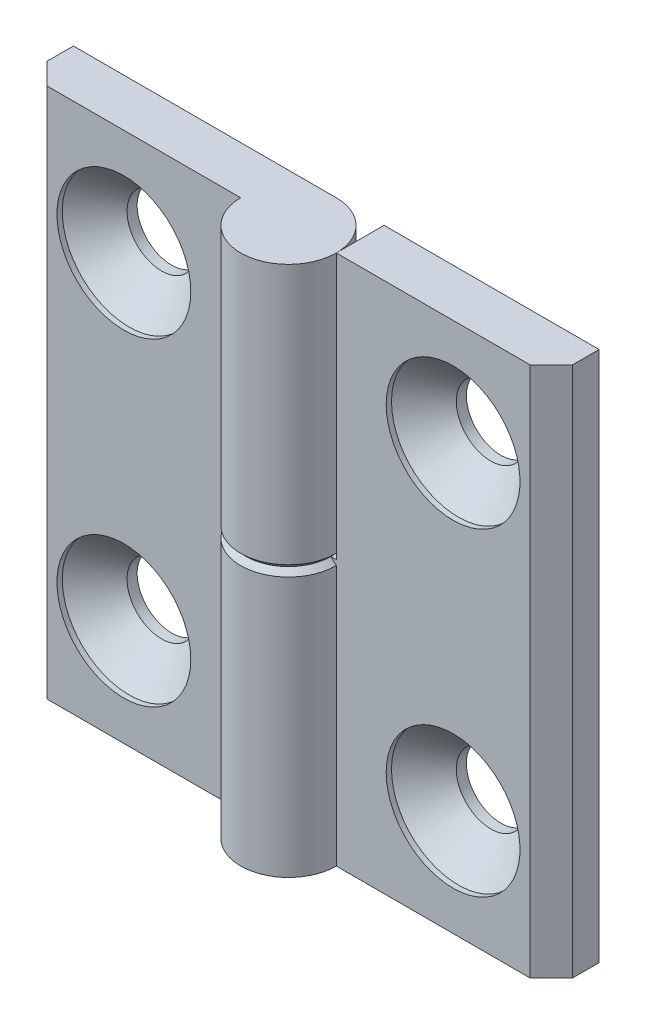
ISO-10303-21;
HEADER;
FILE_DESCRIPTION(('STEP AP214'),'2;1');
FILE_NAME('part.step','',(''),(''),'','','');
FILE_SCHEMA(('AUTOMOTIVE_DESIGN { 1 0 10303 214 1 1 1 1 }'));
ENDSEC;
DATA;
#1=APPLICATION_CONTEXT('core data for automotive mechanical design processes');
#2=APPLICATION_PROTOCOL_DEFINITION('international standard','automotive_design',2000,#1);
#3=PRODUCT_CONTEXT('',#1,'mechanical');
#4=PRODUCT('Part','Part','',(#3));
#5=PRODUCT_RELATED_PRODUCT_CATEGORY('part','',(#4));
#6=PRODUCT_DEFINITION_FORMATION('','',#4);
#7=PRODUCT_DEFINITION_CONTEXT('part definition',#1,'design');
#8=PRODUCT_DEFINITION('design','',#6,#7);
#9=PRODUCT_DEFINITION_SHAPE('','',#8);
#10=(LENGTH_UNIT() NAMED_UNIT(*) SI_UNIT(.MILLI.,.METRE.));
#11=(NAMED_UNIT(*) PLANE_ANGLE_UNIT() SI_UNIT($,.RADIAN.));
#12=(NAMED_UNIT(*) SI_UNIT($,.STERADIAN.) SOLID_ANGLE_UNIT());
#13=UNCERTAINTY_MEASURE_WITH_UNIT(LENGTH_MEASURE(1.E-05),#10,'distance_accuracy_value','');
#14=(GEOMETRIC_REPRESENTATION_CONTEXT(3) GLOBAL_UNCERTAINTY_ASSIGNED_CONTEXT((#13)) GLOBAL_UNIT_ASSIGNED_CONTEXT((#10,
#11,#12)) REPRESENTATION_CONTEXT('',''));
#15=CARTESIAN_POINT('',(0.,0.,0.));
#16=DIRECTION('',(0.,0.,1.));
#17=DIRECTION('',(1.,0.,0.));
#18=AXIS2_PLACEMENT_3D('',#15,#16,#17);
#19=CARTESIAN_POINT('',(0.,-25.,0.));
#20=DIRECTION('',(0.,1.,0.));
#21=DIRECTION('',(0.,0.,-1.));
#22=AXIS2_PLACEMENT_3D('',#19,#20,#21);
#23=CYLINDRICAL_SURFACE('',#22,4.5);
#24=DIRECTION('',(0.,1.,0.));
#25=VECTOR('',#24,1.);
#26=CARTESIAN_POINT('',(4.5,-25.,0.));
#27=LINE('',#26,#25);
#28=CARTESIAN_POINT('',(4.5,-25.,0.));
#29=VERTEX_POINT('',#28);
#30=CARTESIAN_POINT('',(4.5,-0.499999999999987,0.));
#31=VERTEX_POINT('',#30);
#32=EDGE_CURVE('E157',#29,#31,#27,.T.);
#33=ORIENTED_EDGE('',*,*,#32,.T.);
#34=CARTESIAN_POINT('',(0.,-0.499999999999987,0.));
#35=DIRECTION('',(0.,-1.,0.));
#36=DIRECTION('',(0.,0.,1.));
#37=AXIS2_PLACEMENT_3D('',#34,#35,#36);
#38=CIRCLE('',#37,4.5);
#39=CARTESIAN_POINT('',(0.,-0.499999999999987,-4.5));
#40=VERTEX_POINT('',#39);
#41=EDGE_CURVE('E175',#31,#40,#38,.T.);
#42=ORIENTED_EDGE('',*,*,#41,.T.);
#43=DIRECTION('',(0.,1.,0.));
#44=VECTOR('',#43,1.);
#45=CARTESIAN_POINT('',(0.,-25.,-4.5));
#46=LINE('',#45,#44);
#47=CARTESIAN_POINT('',(0.,-25.,-4.5));
#48=VERTEX_POINT('',#47);
#49=EDGE_CURVE('E167',#48,#40,#46,.T.);
#50=ORIENTED_EDGE('',*,*,#49,.F.);
#51=CARTESIAN_POINT('',(0.,-25.,0.));
#52=DIRECTION('',(0.,-1.,0.));
#53=DIRECTION('',(0.,0.,1.));
#54=AXIS2_PLACEMENT_3D('',#51,#52,#53);
#55=CIRCLE('',#54,4.5);
#56=EDGE_CURVE('E156',#29,#48,#55,.T.);
#57=ORIENTED_EDGE('',*,*,#56,.F.);
#58=EDGE_LOOP('',(#33,#42,#50,#57));
#59=FACE_BOUND('',#58,.T.);
#60=ADVANCED_FACE('F46',(#59),#23,.T.);
#61=CARTESIAN_POINT('',(0.,-25.,-4.5));
#62=DIRECTION('',(0.,0.,1.));
#63=DIRECTION('',(-1.,0.,0.));
#64=AXIS2_PLACEMENT_3D('',#61,#62,#63);
#65=PLANE('',#64);
#66=CARTESIAN_POINT('',(15.5,-15.,-4.50000000000012));
#67=DIRECTION('',(0.,0.,1.));
#68=DIRECTION('',(-1.,0.,0.));
#69=AXIS2_PLACEMENT_3D('',#66,#67,#68);
#70=CIRCLE('',#69,3.25);
#71=CARTESIAN_POINT('',(12.25,-15.,-4.50000000000009));
#72=VERTEX_POINT('',#71);
#73=EDGE_CURVE('E197',#72,#72,#70,.T.);
#74=ORIENTED_EDGE('',*,*,#73,.T.);
#75=EDGE_LOOP('',(#74));
#76=FACE_BOUND('',#75,.T.);
#77=CARTESIAN_POINT('',(15.5,15.,-4.50000000000012));
#78=DIRECTION('',(0.,0.,1.));
#79=DIRECTION('',(-1.,0.,0.));
#80=AXIS2_PLACEMENT_3D('',#77,#78,#79);
#81=CIRCLE('',#80,3.25);
#82=CARTESIAN_POINT('',(12.25,15.,-4.50000000000009));
#83=VERTEX_POINT('',#82);
#84=EDGE_CURVE('E139',#83,#83,#81,.T.);
#85=ORIENTED_EDGE('',*,*,#84,.T.);
#86=EDGE_LOOP('',(#85));
#87=FACE_BOUND('',#86,.T.);
#88=ORIENTED_EDGE('',*,*,#49,.T.);
#89=DIRECTION('',(1.,0.,0.));
#90=VECTOR('',#89,1.);
#91=CARTESIAN_POINT('',(0.,-0.499999999999987,-4.5));
#92=LINE('',#91,#90);
#93=CARTESIAN_POINT('',(4.49999999999997,-0.499999999999987,-4.50000000000003));
#94=VERTEX_POINT('',#93);
#95=EDGE_CURVE('E138',#40,#94,#92,.T.);
#96=ORIENTED_EDGE('',*,*,#95,.T.);
#97=DIRECTION('',(0.,1.,0.));
#98=VECTOR('',#97,1.);
#99=CARTESIAN_POINT('',(4.49999999999997,25.,-4.50000000000003));
#100=LINE('',#99,#98);
#101=CARTESIAN_POINT('',(4.49999999999997,25.,-4.50000000000003));
#102=VERTEX_POINT('',#101);
#103=EDGE_CURVE('E119',#94,#102,#100,.T.);
#104=ORIENTED_EDGE('',*,*,#103,.T.);
#105=DIRECTION('',(1.,0.,0.));
#106=VECTOR('',#105,1.);
#107=CARTESIAN_POINT('',(0.,25.,-4.5));
#108=LINE('',#107,#106);
#109=CARTESIAN_POINT('',(24.75,25.,-4.50000000000018));
#110=VERTEX_POINT('',#109);
#111=EDGE_CURVE('E135',#102,#110,#108,.T.);
#112=ORIENTED_EDGE('',*,*,#111,.T.);
#113=DIRECTION('',(0.,1.,0.));
#114=VECTOR('',#113,1.);
#115=CARTESIAN_POINT('',(24.75,-25.,-4.50000000000018));
#116=LINE('',#115,#114);
#117=CARTESIAN_POINT('',(24.75,-25.,-4.50000000000018));
#118=VERTEX_POINT('',#117);
#119=EDGE_CURVE('E165',#118,#110,#116,.T.);
#120=ORIENTED_EDGE('',*,*,#119,.F.);
#121=DIRECTION('',(1.,0.,0.));
#122=VECTOR('',#121,1.);
#123=CARTESIAN_POINT('',(0.,-25.,-4.5));
#124=LINE('',#123,#122);
#125=EDGE_CURVE('E213',#48,#118,#124,.T.);
#126=ORIENTED_EDGE('',*,*,#125,.F.);
#127=EDGE_LOOP('',(#88,#96,#104,#112,#120,#126));
#128=FACE_BOUND('',#127,.T.);
#129=ADVANCED_FACE('F133',(#76,#87,#128),#65,.F.);
#130=CARTESIAN_POINT('',(24.75,-25.,-4.50000000000018));
#131=DIRECTION('',(-1.,0.,0.));
#132=DIRECTION('',(0.,0.,-1.));
#133=AXIS2_PLACEMENT_3D('',#130,#131,#132);
#134=PLANE('',#133);
#135=DIRECTION('',(0.,0.,1.));
#136=VECTOR('',#135,1.);
#137=CARTESIAN_POINT('',(24.75,25.,-4.50000000000018));
#138=LINE('',#137,#136);
#139=CARTESIAN_POINT('',(24.75,25.,-2.00000000000018));
#140=VERTEX_POINT('',#139);
#141=EDGE_CURVE('E144',#110,#140,#138,.T.);
#142=ORIENTED_EDGE('',*,*,#141,.T.);
#143=DIRECTION('',(0.,1.,0.));
#144=VECTOR('',#143,1.);
#145=CARTESIAN_POINT('',(24.75,-25.,-2.00000000000018));
#146=LINE('',#145,#144);
#147=CARTESIAN_POINT('',(24.75,-25.,-2.00000000000018));
#148=VERTEX_POINT('',#147);
#149=EDGE_CURVE('E162',#148,#140,#146,.T.);
#150=ORIENTED_EDGE('',*,*,#149,.F.);
#151=DIRECTION('',(0.,0.,1.));
#152=VECTOR('',#151,1.);
#153=CARTESIAN_POINT('',(24.75,-25.,-4.50000000000018));
#154=LINE('',#153,#152);
#155=EDGE_CURVE('E215',#118,#148,#154,.T.);
#156=ORIENTED_EDGE('',*,*,#155,.F.);
#157=ORIENTED_EDGE('',*,*,#119,.T.);
#158=EDGE_LOOP('',(#142,#150,#156,#157));
#159=FACE_BOUND('',#158,.T.);
#160=ADVANCED_FACE('F229',(#159),#134,.F.);
#161=CARTESIAN_POINT('',(24.75,-25.,-2.00000000000018));
#162=DIRECTION('',(-0.707106781186548,0.,-0.707106781186547));
#163=DIRECTION('',(0.707106781186547,0.,-0.707106781186548));
#164=AXIS2_PLACEMENT_3D('',#161,#162,#163);
#165=PLANE('',#164);
#166=DIRECTION('',(-0.707106781186547,0.,0.707106781186548));
#167=VECTOR('',#166,1.);
#168=CARTESIAN_POINT('',(24.75,25.,-2.00000000000018));
#169=LINE('',#168,#167);
#170=CARTESIAN_POINT('',(22.75,25.,-1.70068490391401E-13));
#171=VERTEX_POINT('',#170);
#172=EDGE_CURVE('E146',#140,#171,#169,.T.);
#173=ORIENTED_EDGE('',*,*,#172,.T.);
#174=DIRECTION('',(0.,1.,0.));
#175=VECTOR('',#174,1.);
#176=CARTESIAN_POINT('',(22.75,-25.,-1.70068490391401E-13));
#177=LINE('',#176,#175);
#178=CARTESIAN_POINT('',(22.75,-25.,-1.70068490391401E-13));
#179=VERTEX_POINT('',#178);
#180=EDGE_CURVE('E159',#179,#171,#177,.T.);
#181=ORIENTED_EDGE('',*,*,#180,.F.);
#182=DIRECTION('',(-0.707106781186547,0.,0.707106781186548));
#183=VECTOR('',#182,1.);
#184=CARTESIAN_POINT('',(24.75,-25.,-2.00000000000018));
#185=LINE('',#184,#183);
#186=EDGE_CURVE('E216',#148,#179,#185,.T.);
#187=ORIENTED_EDGE('',*,*,#186,.F.);
#188=ORIENTED_EDGE('',*,*,#149,.T.);
#189=EDGE_LOOP('',(#173,#181,#187,#188));
#190=FACE_BOUND('',#189,.T.);
#191=ADVANCED_FACE('F231',(#190),#165,.F.);
#192=CARTESIAN_POINT('',(22.75,-25.,-1.70068490391401E-13));
#193=DIRECTION('',(0.,0.,-1.));
#194=DIRECTION('',(1.,0.,0.));
#195=AXIS2_PLACEMENT_3D('',#192,#193,#194);
#196=PLANE('',#195);
#197=CARTESIAN_POINT('',(15.5,-15.,-1.16045572093348E-13));
#198=DIRECTION('',(0.,0.,1.));
#199=DIRECTION('',(-1.,0.,0.));
#200=AXIS2_PLACEMENT_3D('',#197,#198,#199);
#201=CIRCLE('',#200,6.3);
#202=CARTESIAN_POINT('',(9.2,-15.,0.));
#203=VERTEX_POINT('',#202);
#204=EDGE_CURVE('E185',#203,#203,#201,.T.);
#205=ORIENTED_EDGE('',*,*,#204,.F.);
#206=EDGE_LOOP('',(#205));
#207=FACE_BOUND('',#206,.T.);
#208=CARTESIAN_POINT('',(15.5,15.,-1.16045572093348E-13));
#209=DIRECTION('',(0.,0.,1.));
#210=DIRECTION('',(-1.,0.,0.));
#211=AXIS2_PLACEMENT_3D('',#208,#209,#210);
#212=CIRCLE('',#211,6.3);
#213=CARTESIAN_POINT('',(9.2,15.,0.));
#214=VERTEX_POINT('',#213);
#215=EDGE_CURVE('E200',#214,#214,#212,.T.);
#216=ORIENTED_EDGE('',*,*,#215,.F.);
#217=EDGE_LOOP('',(#216));
#218=FACE_BOUND('',#217,.T.);
#219=DIRECTION('',(-1.,0.,0.));
#220=VECTOR('',#219,1.);
#221=CARTESIAN_POINT('',(22.75,25.,-1.70068490391401E-13));
#222=LINE('',#221,#220);
#223=CARTESIAN_POINT('',(4.5,25.,0.));
#224=VERTEX_POINT('',#223);
#225=EDGE_CURVE('E154',#171,#224,#222,.T.);
#226=ORIENTED_EDGE('',*,*,#225,.T.);
#227=DIRECTION('',(0.,-1.,0.));
#228=VECTOR('',#227,1.);
#229=CARTESIAN_POINT('',(4.5,-25.,0.));
#230=LINE('',#229,#228);
#231=CARTESIAN_POINT('',(4.5,0.,0.));
#232=VERTEX_POINT('',#231);
#233=EDGE_CURVE('E123',#224,#232,#230,.T.);
#234=ORIENTED_EDGE('',*,*,#233,.T.);
#235=DIRECTION('',(1.,0.,0.));
#236=VECTOR('',#235,1.);
#237=CARTESIAN_POINT('',(-4.5,0.,0.));
#238=LINE('',#237,#236);
#239=CARTESIAN_POINT('',(4.00000000000001,0.,0.));
#240=VERTEX_POINT('',#239);
#241=EDGE_CURVE('E170',#240,#232,#238,.T.);
#242=ORIENTED_EDGE('',*,*,#241,.F.);
#243=DIRECTION('',(0.707106781186553,-0.707106781186542,0.));
#244=VECTOR('',#243,1.);
#245=CARTESIAN_POINT('',(0.,3.99999999999994,0.));
#246=LINE('',#245,#244);
#247=EDGE_CURVE('E12',#240,#31,#246,.T.);
#248=ORIENTED_EDGE('',*,*,#247,.T.);
#249=ORIENTED_EDGE('',*,*,#32,.F.);
#250=DIRECTION('',(-1.,0.,0.));
#251=VECTOR('',#250,1.);
#252=CARTESIAN_POINT('',(22.75,-25.,-1.70068490391401E-13));
#253=LINE('',#252,#251);
#254=EDGE_CURVE('E150',#179,#29,#253,.T.);
#255=ORIENTED_EDGE('',*,*,#254,.F.);
#256=ORIENTED_EDGE('',*,*,#180,.T.);
#257=EDGE_LOOP('',(#226,#234,#242,#248,#249,#255,#256));
#258=FACE_BOUND('',#257,.T.);
#259=ADVANCED_FACE('F224',(#207,#218,#258),#196,.F.);
#260=CARTESIAN_POINT('',(0.,-25.,0.));
#261=DIRECTION('',(0.,-1.,0.));
#262=DIRECTION('',(0.,0.,1.));
#263=AXIS2_PLACEMENT_3D('',#260,#261,#262);
#264=PLANE('',#263);
#265=ORIENTED_EDGE('',*,*,#56,.T.);
#266=ORIENTED_EDGE('',*,*,#125,.T.);
#267=ORIENTED_EDGE('',*,*,#155,.T.);
#268=ORIENTED_EDGE('',*,*,#186,.T.);
#269=ORIENTED_EDGE('',*,*,#254,.T.);
#270=EDGE_LOOP('',(#265,#266,#267,#268,#269));
#271=FACE_BOUND('',#270,.T.);
#272=ADVANCED_FACE('F221',(#271),#264,.T.);
#273=CARTESIAN_POINT('',(0.,25.,0.));
#274=DIRECTION('',(0.,-1.,0.));
#275=DIRECTION('',(0.,0.,1.));
#276=AXIS2_PLACEMENT_3D('',#273,#274,#275);
#277=PLANE('',#276);
#278=ORIENTED_EDGE('',*,*,#111,.F.);
#279=DIRECTION('',(0.,0.,1.));
#280=VECTOR('',#279,1.);
#281=CARTESIAN_POINT('',(4.49999999999997,25.,-4.50000000000003));
#282=LINE('',#281,#280);
#283=EDGE_CURVE('E116',#102,#224,#282,.T.);
#284=ORIENTED_EDGE('',*,*,#283,.T.);
#285=ORIENTED_EDGE('',*,*,#225,.F.);
#286=ORIENTED_EDGE('',*,*,#172,.F.);
#287=ORIENTED_EDGE('',*,*,#141,.F.);
#288=EDGE_LOOP('',(#278,#284,#285,#286,#287));
#289=FACE_BOUND('',#288,.T.);
#290=ADVANCED_FACE('F142',(#289),#277,.F.);
#291=CARTESIAN_POINT('',(-4.50000000000003,0.,-4.49999999999997));
#292=DIRECTION('',(0.,-1.,0.));
#293=DIRECTION('',(0.,0.,1.));
#294=AXIS2_PLACEMENT_3D('',#291,#292,#293);
#295=PLANE('',#294);
#296=DIRECTION('',(0.,0.,1.));
#297=VECTOR('',#296,1.);
#298=CARTESIAN_POINT('',(4.49999999999997,0.,-4.50000000000003));
#299=LINE('',#298,#297);
#300=CARTESIAN_POINT('',(4.49999999999997,0.,-4.00000000000004));
#301=VERTEX_POINT('',#300);
#302=EDGE_CURVE('E128',#301,#232,#299,.T.);
#303=ORIENTED_EDGE('',*,*,#302,.F.);
#304=DIRECTION('',(-1.,0.,0.));
#305=VECTOR('',#304,1.);
#306=CARTESIAN_POINT('',(-4.50000000000003,0.,-3.99999999999997));
#307=LINE('',#306,#305);
#308=CARTESIAN_POINT('',(0.,0.,-4.00000000000001));
#309=VERTEX_POINT('',#308);
#310=EDGE_CURVE('E69',#301,#309,#307,.T.);
#311=ORIENTED_EDGE('',*,*,#310,.T.);
#312=CARTESIAN_POINT('',(0.,0.,0.));
#313=DIRECTION('',(0.,-1.,0.));
#314=DIRECTION('',(0.,0.,1.));
#315=AXIS2_PLACEMENT_3D('',#312,#313,#314);
#316=CIRCLE('',#315,4.00000000000001);
#317=EDGE_CURVE('E172',#309,#240,#316,.F.);
#318=ORIENTED_EDGE('',*,*,#317,.T.);
#319=ORIENTED_EDGE('',*,*,#241,.T.);
#320=EDGE_LOOP('',(#303,#311,#318,#319));
#321=FACE_BOUND('',#320,.T.);
#322=ADVANCED_FACE('F178',(#321),#295,.F.);
#323=CARTESIAN_POINT('',(4.49999999999997,25.,-4.50000000000003));
#324=DIRECTION('',(1.,0.,0.));
#325=DIRECTION('',(0.,0.,1.));
#326=AXIS2_PLACEMENT_3D('',#323,#324,#325);
#327=PLANE('',#326);
#328=ORIENTED_EDGE('',*,*,#283,.F.);
#329=ORIENTED_EDGE('',*,*,#103,.F.);
#330=DIRECTION('',(0.,-0.707106781186542,-0.707106781186553));
#331=VECTOR('',#330,1.);
#332=CARTESIAN_POINT('',(4.50000000000006,12.2499999999998,8.24999999999996));
#333=LINE('',#332,#331);
#334=EDGE_CURVE('E56',#94,#301,#333,.F.);
#335=ORIENTED_EDGE('',*,*,#334,.T.);
#336=ORIENTED_EDGE('',*,*,#302,.T.);
#337=ORIENTED_EDGE('',*,*,#233,.F.);
#338=EDGE_LOOP('',(#328,#329,#335,#336,#337));
#339=FACE_BOUND('',#338,.T.);
#340=ADVANCED_FACE('F118',(#339),#327,.F.);
#341=CARTESIAN_POINT('',(15.5,15.,-1.15828731658851E-13));
#342=DIRECTION('',(0.,0.,1.));
#343=DIRECTION('',(-1.,0.,0.));
#344=AXIS2_PLACEMENT_3D('',#341,#342,#343);
#345=CYLINDRICAL_SURFACE('',#344,3.25);
#346=ORIENTED_EDGE('',*,*,#84,.F.);
#347=EDGE_LOOP('',(#346));
#348=FACE_BOUND('',#347,.T.);
#349=CARTESIAN_POINT('',(15.5,15.,-3.55000000000011));
#350=DIRECTION('',(0.,0.,1.));
#351=DIRECTION('',(-1.,0.,0.));
#352=AXIS2_PLACEMENT_3D('',#349,#350,#351);
#353=CIRCLE('',#352,3.25);
#354=CARTESIAN_POINT('',(12.25,15.,-3.55000000000009));
#355=VERTEX_POINT('',#354);
#356=EDGE_CURVE('E206',#355,#355,#353,.T.);
#357=ORIENTED_EDGE('',*,*,#356,.T.);
#358=EDGE_LOOP('',(#357));
#359=FACE_BOUND('',#358,.T.);
#360=ADVANCED_FACE('F269',(#348,#359),#345,.F.);
#361=CARTESIAN_POINT('',(15.5,15.,-0.500000000000116));
#362=DIRECTION('',(0.,0.,1.));
#363=DIRECTION('',(-1.,0.,0.));
#364=AXIS2_PLACEMENT_3D('',#361,#362,#363);
#365=CONICAL_SURFACE('',#364,6.3,0.785398163397449);
#366=ORIENTED_EDGE('',*,*,#356,.F.);
#367=EDGE_LOOP('',(#366));
#368=FACE_BOUND('',#367,.T.);
#369=CARTESIAN_POINT('',(15.5,15.,-0.500000000000116));
#370=DIRECTION('',(0.,0.,1.));
#371=DIRECTION('',(-1.,0.,0.));
#372=AXIS2_PLACEMENT_3D('',#369,#370,#371);
#373=CIRCLE('',#372,6.3);
#374=CARTESIAN_POINT('',(9.19999999999999,15.,-0.500000000000069));
#375=VERTEX_POINT('',#374);
#376=EDGE_CURVE('E203',#375,#375,#373,.T.);
#377=ORIENTED_EDGE('',*,*,#376,.T.);
#378=EDGE_LOOP('',(#377));
#379=FACE_BOUND('',#378,.T.);
#380=ADVANCED_FACE('F272',(#368,#379),#365,.F.);
#381=CARTESIAN_POINT('',(15.5,15.,-1.15828731658851E-13));
#382=DIRECTION('',(0.,0.,1.));
#383=DIRECTION('',(-1.,0.,0.));
#384=AXIS2_PLACEMENT_3D('',#381,#382,#383);
#385=CYLINDRICAL_SURFACE('',#384,6.3);
#386=ORIENTED_EDGE('',*,*,#376,.F.);
#387=EDGE_LOOP('',(#386));
#388=FACE_BOUND('',#387,.T.);
#389=ORIENTED_EDGE('',*,*,#215,.T.);
#390=EDGE_LOOP('',(#389));
#391=FACE_BOUND('',#390,.T.);
#392=ADVANCED_FACE('F276',(#388,#391),#385,.F.);
#393=CARTESIAN_POINT('',(15.5,-15.,-1.15828731658851E-13));
#394=DIRECTION('',(0.,0.,1.));
#395=DIRECTION('',(-1.,0.,0.));
#396=AXIS2_PLACEMENT_3D('',#393,#394,#395);
#397=CYLINDRICAL_SURFACE('',#396,3.25);
#398=ORIENTED_EDGE('',*,*,#73,.F.);
#399=EDGE_LOOP('',(#398));
#400=FACE_BOUND('',#399,.T.);
#401=CARTESIAN_POINT('',(15.5,-15.,-3.55000000000011));
#402=DIRECTION('',(0.,0.,1.));
#403=DIRECTION('',(-1.,0.,0.));
#404=AXIS2_PLACEMENT_3D('',#401,#402,#403);
#405=CIRCLE('',#404,3.25);
#406=CARTESIAN_POINT('',(12.25,-15.,-3.55000000000009));
#407=VERTEX_POINT('',#406);
#408=EDGE_CURVE('E192',#407,#407,#405,.T.);
#409=ORIENTED_EDGE('',*,*,#408,.T.);
#410=EDGE_LOOP('',(#409));
#411=FACE_BOUND('',#410,.T.);
#412=ADVANCED_FACE('F280',(#400,#411),#397,.F.);
#413=CARTESIAN_POINT('',(15.5,-15.,-0.500000000000116));
#414=DIRECTION('',(0.,0.,1.));
#415=DIRECTION('',(-1.,0.,0.));
#416=AXIS2_PLACEMENT_3D('',#413,#414,#415);
#417=CONICAL_SURFACE('',#416,6.3,0.785398163397449);
#418=ORIENTED_EDGE('',*,*,#408,.F.);
#419=EDGE_LOOP('',(#418));
#420=FACE_BOUND('',#419,.T.);
#421=CARTESIAN_POINT('',(15.5,-15.,-0.500000000000116));
#422=DIRECTION('',(0.,0.,1.));
#423=DIRECTION('',(-1.,0.,0.));
#424=AXIS2_PLACEMENT_3D('',#421,#422,#423);
#425=CIRCLE('',#424,6.3);
#426=CARTESIAN_POINT('',(9.19999999999999,-15.,-0.500000000000069));
#427=VERTEX_POINT('',#426);
#428=EDGE_CURVE('E187',#427,#427,#425,.T.);
#429=ORIENTED_EDGE('',*,*,#428,.T.);
#430=EDGE_LOOP('',(#429));
#431=FACE_BOUND('',#430,.T.);
#432=ADVANCED_FACE('F238',(#420,#431),#417,.F.);
#433=CARTESIAN_POINT('',(15.5,-15.,-1.15828731658851E-13));
#434=DIRECTION('',(0.,0.,1.));
#435=DIRECTION('',(-1.,0.,0.));
#436=AXIS2_PLACEMENT_3D('',#433,#434,#435);
#437=CYLINDRICAL_SURFACE('',#436,6.3);
#438=ORIENTED_EDGE('',*,*,#428,.F.);
#439=EDGE_LOOP('',(#438));
#440=FACE_BOUND('',#439,.T.);
#441=ORIENTED_EDGE('',*,*,#204,.T.);
#442=EDGE_LOOP('',(#441));
#443=FACE_BOUND('',#442,.T.);
#444=ADVANCED_FACE('F233',(#440,#443),#437,.F.);
#445=CARTESIAN_POINT('',(0.,-0.499999999999987,0.));
#446=DIRECTION('',(0.,-1.,0.));
#447=DIRECTION('',(0.,0.,1.));
#448=AXIS2_PLACEMENT_3D('',#445,#446,#447);
#449=CONICAL_SURFACE('',#448,4.5,0.785398163397456);
#450=ORIENTED_EDGE('',*,*,#247,.F.);
#451=ORIENTED_EDGE('',*,*,#317,.F.);
#452=DIRECTION('',(0.,0.707106781186542,0.707106781186553));
#453=VECTOR('',#452,1.);
#454=CARTESIAN_POINT('',(0.,-0.499999999999987,-4.5));
#455=LINE('',#454,#453);
#456=EDGE_CURVE('E51',#40,#309,#455,.T.);
#457=ORIENTED_EDGE('',*,*,#456,.F.);
#458=ORIENTED_EDGE('',*,*,#41,.F.);
#459=EDGE_LOOP('',(#450,#451,#457,#458));
#460=FACE_BOUND('',#459,.T.);
#461=ADVANCED_FACE('F49',(#460),#449,.T.);
#462=CARTESIAN_POINT('',(0.,-0.499999999999987,-4.5));
#463=DIRECTION('',(0.,-0.707106781186553,0.707106781186542));
#464=DIRECTION('',(1.,0.,0.));
#465=AXIS2_PLACEMENT_3D('',#462,#463,#464);
#466=PLANE('',#465);
#467=ORIENTED_EDGE('',*,*,#456,.T.);
#468=ORIENTED_EDGE('',*,*,#310,.F.);
#469=ORIENTED_EDGE('',*,*,#334,.F.);
#470=ORIENTED_EDGE('',*,*,#95,.F.);
#471=EDGE_LOOP('',(#467,#468,#469,#470));
#472=FACE_BOUND('',#471,.T.);
#473=ADVANCED_FACE('F181',(#472),#466,.F.);
#474=CLOSED_SHELL('',(#60,#129,#160,#191,#259,#272,#290,#322,#340,#360,#380,#392,#412,#432,#444,
#461,#473));
#475=MANIFOLD_SOLID_BREP('B2',#474);
#476=CARTESIAN_POINT('',(0.,25.,0.));
#477=DIRECTION('',(0.,-1.,0.));
#478=DIRECTION('',(0.,0.,-1.));
#479=AXIS2_PLACEMENT_3D('',#476,#477,#478);
#480=CYLINDRICAL_SURFACE('',#479,4.5);
#481=DIRECTION('',(0.,-1.,0.));
#482=VECTOR('',#481,1.);
#483=CARTESIAN_POINT('',(-4.5,25.,0.));
#484=LINE('',#483,#482);
#485=CARTESIAN_POINT('',(-4.5,25.,0.));
#486=VERTEX_POINT('',#485);
#487=CARTESIAN_POINT('',(-4.5,0.499999999999987,0.));
#488=VERTEX_POINT('',#487);
#489=EDGE_CURVE('E512',#486,#488,#484,.T.);
#490=ORIENTED_EDGE('',*,*,#489,.T.);
#491=CARTESIAN_POINT('',(0.,0.499999999999987,0.));
#492=DIRECTION('',(0.,1.,0.));
#493=DIRECTION('',(0.,0.,1.));
#494=AXIS2_PLACEMENT_3D('',#491,#492,#493);
#495=CIRCLE('',#494,4.5);
#496=CARTESIAN_POINT('',(0.,0.499999999999987,-4.5));
#497=VERTEX_POINT('',#496);
#498=EDGE_CURVE('E530',#488,#497,#495,.T.);
#499=ORIENTED_EDGE('',*,*,#498,.T.);
#500=DIRECTION('',(0.,-1.,0.));
#501=VECTOR('',#500,1.);
#502=CARTESIAN_POINT('',(0.,25.,-4.5));
#503=LINE('',#502,#501);
#504=CARTESIAN_POINT('',(0.,25.,-4.5));
#505=VERTEX_POINT('',#504);
#506=EDGE_CURVE('E522',#505,#497,#503,.T.);
#507=ORIENTED_EDGE('',*,*,#506,.F.);
#508=CARTESIAN_POINT('',(0.,25.,0.));
#509=DIRECTION('',(0.,1.,0.));
#510=DIRECTION('',(0.,0.,1.));
#511=AXIS2_PLACEMENT_3D('',#508,#509,#510);
#512=CIRCLE('',#511,4.5);
#513=EDGE_CURVE('E511',#486,#505,#512,.T.);
#514=ORIENTED_EDGE('',*,*,#513,.F.);
#515=EDGE_LOOP('',(#490,#499,#507,#514));
#516=FACE_BOUND('',#515,.T.);
#517=ADVANCED_FACE('F401',(#516),#480,.T.);
#518=CARTESIAN_POINT('',(0.,25.,-4.5));
#519=DIRECTION('',(0.,0.,1.));
#520=DIRECTION('',(1.,0.,0.));
#521=AXIS2_PLACEMENT_3D('',#518,#519,#520);
#522=PLANE('',#521);
#523=CARTESIAN_POINT('',(-15.5,15.,-4.5));
#524=DIRECTION('',(0.,0.,1.));
#525=DIRECTION('',(1.,0.,0.));
#526=AXIS2_PLACEMENT_3D('',#523,#524,#525);
#527=CIRCLE('',#526,3.25);
#528=CARTESIAN_POINT('',(-12.25,15.,-4.5));
#529=VERTEX_POINT('',#528);
#530=EDGE_CURVE('E552',#529,#529,#527,.T.);
#531=ORIENTED_EDGE('',*,*,#530,.T.);
#532=EDGE_LOOP('',(#531));
#533=FACE_BOUND('',#532,.T.);
#534=CARTESIAN_POINT('',(-15.5,-15.,-4.5));
#535=DIRECTION('',(0.,0.,1.));
#536=DIRECTION('',(1.,0.,0.));
#537=AXIS2_PLACEMENT_3D('',#534,#535,#536);
#538=CIRCLE('',#537,3.25);
#539=CARTESIAN_POINT('',(-12.25,-15.,-4.5));
#540=VERTEX_POINT('',#539);
#541=EDGE_CURVE('E494',#540,#540,#538,.T.);
#542=ORIENTED_EDGE('',*,*,#541,.T.);
#543=EDGE_LOOP('',(#542));
#544=FACE_BOUND('',#543,.T.);
#545=ORIENTED_EDGE('',*,*,#506,.T.);
#546=DIRECTION('',(-1.,0.,0.));
#547=VECTOR('',#546,1.);
#548=CARTESIAN_POINT('',(0.,0.499999999999987,-4.5));
#549=LINE('',#548,#547);
#550=CARTESIAN_POINT('',(-4.5,0.499999999999987,-4.5));
#551=VERTEX_POINT('',#550);
#552=EDGE_CURVE('E493',#497,#551,#549,.T.);
#553=ORIENTED_EDGE('',*,*,#552,.T.);
#554=DIRECTION('',(0.,-1.,0.));
#555=VECTOR('',#554,1.);
#556=CARTESIAN_POINT('',(-4.5,-25.,-4.5));
#557=LINE('',#556,#555);
#558=CARTESIAN_POINT('',(-4.5,-25.,-4.5));
#559=VERTEX_POINT('',#558);
#560=EDGE_CURVE('E474',#551,#559,#557,.T.);
#561=ORIENTED_EDGE('',*,*,#560,.T.);
#562=DIRECTION('',(-1.,0.,0.));
#563=VECTOR('',#562,1.);
#564=CARTESIAN_POINT('',(0.,-25.,-4.5));
#565=LINE('',#564,#563);
#566=CARTESIAN_POINT('',(-24.75,-25.,-4.5));
#567=VERTEX_POINT('',#566);
#568=EDGE_CURVE('E490',#559,#567,#565,.T.);
#569=ORIENTED_EDGE('',*,*,#568,.T.);
#570=DIRECTION('',(0.,-1.,0.));
#571=VECTOR('',#570,1.);
#572=CARTESIAN_POINT('',(-24.75,25.,-4.5));
#573=LINE('',#572,#571);
#574=CARTESIAN_POINT('',(-24.75,25.,-4.5));
#575=VERTEX_POINT('',#574);
#576=EDGE_CURVE('E520',#575,#567,#573,.T.);
#577=ORIENTED_EDGE('',*,*,#576,.F.);
#578=DIRECTION('',(-1.,0.,0.));
#579=VECTOR('',#578,1.);
#580=CARTESIAN_POINT('',(0.,25.,-4.5));
#581=LINE('',#580,#579);
#582=EDGE_CURVE('E568',#505,#575,#581,.T.);
#583=ORIENTED_EDGE('',*,*,#582,.F.);
#584=EDGE_LOOP('',(#545,#553,#561,#569,#577,#583));
#585=FACE_BOUND('',#584,.T.);
#586=ADVANCED_FACE('F488',(#533,#544,#585),#522,.F.);
#587=CARTESIAN_POINT('',(-24.75,25.,-4.5));
#588=DIRECTION('',(1.,0.,0.));
#589=DIRECTION('',(0.,0.,-1.));
#590=AXIS2_PLACEMENT_3D('',#587,#588,#589);
#591=PLANE('',#590);
#592=DIRECTION('',(0.,0.,1.));
#593=VECTOR('',#592,1.);
#594=CARTESIAN_POINT('',(-24.75,-25.,-4.5));
#595=LINE('',#594,#593);
#596=CARTESIAN_POINT('',(-24.75,-25.,-2.));
#597=VERTEX_POINT('',#596);
#598=EDGE_CURVE('E499',#567,#597,#595,.T.);
#599=ORIENTED_EDGE('',*,*,#598,.T.);
#600=DIRECTION('',(0.,-1.,0.));
#601=VECTOR('',#600,1.);
#602=CARTESIAN_POINT('',(-24.75,25.,-2.));
#603=LINE('',#602,#601);
#604=CARTESIAN_POINT('',(-24.75,25.,-2.));
#605=VERTEX_POINT('',#604);
#606=EDGE_CURVE('E517',#605,#597,#603,.T.);
#607=ORIENTED_EDGE('',*,*,#606,.F.);
#608=DIRECTION('',(0.,0.,1.));
#609=VECTOR('',#608,1.);
#610=CARTESIAN_POINT('',(-24.75,25.,-4.5));
#611=LINE('',#610,#609);
#612=EDGE_CURVE('E570',#575,#605,#611,.T.);
#613=ORIENTED_EDGE('',*,*,#612,.F.);
#614=ORIENTED_EDGE('',*,*,#576,.T.);
#615=EDGE_LOOP('',(#599,#607,#613,#614));
#616=FACE_BOUND('',#615,.T.);
#617=ADVANCED_FACE('F584',(#616),#591,.F.);
#618=CARTESIAN_POINT('',(-24.75,25.,-2.));
#619=DIRECTION('',(0.707106781186543,0.,-0.707106781186552));
#620=DIRECTION('',(-0.707106781186552,0.,-0.707106781186543));
#621=AXIS2_PLACEMENT_3D('',#618,#619,#620);
#622=PLANE('',#621);
#623=DIRECTION('',(0.707106781186552,0.,0.707106781186543));
#624=VECTOR('',#623,1.);
#625=CARTESIAN_POINT('',(-24.75,-25.,-2.));
#626=LINE('',#625,#624);
#627=CARTESIAN_POINT('',(-22.75,-25.,0.));
#628=VERTEX_POINT('',#627);
#629=EDGE_CURVE('E501',#597,#628,#626,.T.);
#630=ORIENTED_EDGE('',*,*,#629,.T.);
#631=DIRECTION('',(0.,-1.,0.));
#632=VECTOR('',#631,1.);
#633=CARTESIAN_POINT('',(-22.75,25.,0.));
#634=LINE('',#633,#632);
#635=CARTESIAN_POINT('',(-22.75,25.,0.));
#636=VERTEX_POINT('',#635);
#637=EDGE_CURVE('E514',#636,#628,#634,.T.);
#638=ORIENTED_EDGE('',*,*,#637,.F.);
#639=DIRECTION('',(0.707106781186552,0.,0.707106781186543));
#640=VECTOR('',#639,1.);
#641=CARTESIAN_POINT('',(-24.75,25.,-2.));
#642=LINE('',#641,#640);
#643=EDGE_CURVE('E571',#605,#636,#642,.T.);
#644=ORIENTED_EDGE('',*,*,#643,.F.);
#645=ORIENTED_EDGE('',*,*,#606,.T.);
#646=EDGE_LOOP('',(#630,#638,#644,#645));
#647=FACE_BOUND('',#646,.T.);
#648=ADVANCED_FACE('F586',(#647),#622,.F.);
#649=CARTESIAN_POINT('',(-22.75,25.,0.));
#650=DIRECTION('',(0.,0.,-1.));
#651=DIRECTION('',(-1.,0.,0.));
#652=AXIS2_PLACEMENT_3D('',#649,#650,#651);
#653=PLANE('',#652);
#654=CARTESIAN_POINT('',(-15.5,15.,0.));
#655=DIRECTION('',(0.,0.,1.));
#656=DIRECTION('',(1.,0.,0.));
#657=AXIS2_PLACEMENT_3D('',#654,#655,#656);
#658=CIRCLE('',#657,6.3);
#659=CARTESIAN_POINT('',(-9.2,15.,0.));
#660=VERTEX_POINT('',#659);
#661=EDGE_CURVE('E540',#660,#660,#658,.T.);
#662=ORIENTED_EDGE('',*,*,#661,.F.);
#663=EDGE_LOOP('',(#662));
#664=FACE_BOUND('',#663,.T.);
#665=CARTESIAN_POINT('',(-15.5,-15.,0.));
#666=DIRECTION('',(0.,0.,1.));
#667=DIRECTION('',(1.,0.,0.));
#668=AXIS2_PLACEMENT_3D('',#665,#666,#667);
#669=CIRCLE('',#668,6.3);
#670=CARTESIAN_POINT('',(-9.2,-15.,0.));
#671=VERTEX_POINT('',#670);
#672=EDGE_CURVE('E555',#671,#671,#669,.T.);
#673=ORIENTED_EDGE('',*,*,#672,.F.);
#674=EDGE_LOOP('',(#673));
#675=FACE_BOUND('',#674,.T.);
#676=DIRECTION('',(1.,0.,0.));
#677=VECTOR('',#676,1.);
#678=CARTESIAN_POINT('',(-22.75,-25.,0.));
#679=LINE('',#678,#677);
#680=CARTESIAN_POINT('',(-4.5,-25.,0.));
#681=VERTEX_POINT('',#680);
#682=EDGE_CURVE('E509',#628,#681,#679,.T.);
#683=ORIENTED_EDGE('',*,*,#682,.T.);
#684=DIRECTION('',(0.,1.,0.));
#685=VECTOR('',#684,1.);
#686=CARTESIAN_POINT('',(-4.5,25.,0.));
#687=LINE('',#686,#685);
#688=CARTESIAN_POINT('',(-4.5,0.,0.));
#689=VERTEX_POINT('',#688);
#690=EDGE_CURVE('E478',#681,#689,#687,.T.);
#691=ORIENTED_EDGE('',*,*,#690,.T.);
#692=DIRECTION('',(-1.,0.,0.));
#693=VECTOR('',#692,1.);
#694=CARTESIAN_POINT('',(4.5,0.,0.));
#695=LINE('',#694,#693);
#696=CARTESIAN_POINT('',(-4.00000000000001,0.,0.));
#697=VERTEX_POINT('',#696);
#698=EDGE_CURVE('E525',#697,#689,#695,.T.);
#699=ORIENTED_EDGE('',*,*,#698,.F.);
#700=DIRECTION('',(-0.707106781186553,0.707106781186542,0.));
#701=VECTOR('',#700,1.);
#702=CARTESIAN_POINT('',(0.,-3.99999999999994,0.));
#703=LINE('',#702,#701);
#704=EDGE_CURVE('E44',#697,#488,#703,.T.);
#705=ORIENTED_EDGE('',*,*,#704,.T.);
#706=ORIENTED_EDGE('',*,*,#489,.F.);
#707=DIRECTION('',(1.,0.,0.));
#708=VECTOR('',#707,1.);
#709=CARTESIAN_POINT('',(-22.75,25.,0.));
#710=LINE('',#709,#708);
#711=EDGE_CURVE('E505',#636,#486,#710,.T.);
#712=ORIENTED_EDGE('',*,*,#711,.F.);
#713=ORIENTED_EDGE('',*,*,#637,.T.);
#714=EDGE_LOOP('',(#683,#691,#699,#705,#706,#712,#713));
#715=FACE_BOUND('',#714,.T.);
#716=ADVANCED_FACE('F579',(#664,#675,#715),#653,.F.);
#717=CARTESIAN_POINT('',(0.,25.,0.));
#718=DIRECTION('',(0.,1.,0.));
#719=DIRECTION('',(0.,0.,1.));
#720=AXIS2_PLACEMENT_3D('',#717,#718,#719);
#721=PLANE('',#720);
#722=ORIENTED_EDGE('',*,*,#513,.T.);
#723=ORIENTED_EDGE('',*,*,#582,.T.);
#724=ORIENTED_EDGE('',*,*,#612,.T.);
#725=ORIENTED_EDGE('',*,*,#643,.T.);
#726=ORIENTED_EDGE('',*,*,#711,.T.);
#727=EDGE_LOOP('',(#722,#723,#724,#725,#726));
#728=FACE_BOUND('',#727,.T.);
#729=ADVANCED_FACE('F576',(#728),#721,.T.);
#730=CARTESIAN_POINT('',(0.,-25.,0.));
#731=DIRECTION('',(0.,1.,0.));
#732=DIRECTION('',(0.,0.,1.));
#733=AXIS2_PLACEMENT_3D('',#730,#731,#732);
#734=PLANE('',#733);
#735=ORIENTED_EDGE('',*,*,#568,.F.);
#736=DIRECTION('',(0.,0.,1.));
#737=VECTOR('',#736,1.);
#738=CARTESIAN_POINT('',(-4.5,-25.,-4.5));
#739=LINE('',#738,#737);
#740=EDGE_CURVE('E471',#559,#681,#739,.T.);
#741=ORIENTED_EDGE('',*,*,#740,.T.);
#742=ORIENTED_EDGE('',*,*,#682,.F.);
#743=ORIENTED_EDGE('',*,*,#629,.F.);
#744=ORIENTED_EDGE('',*,*,#598,.F.);
#745=EDGE_LOOP('',(#735,#741,#742,#743,#744));
#746=FACE_BOUND('',#745,.T.);
#747=ADVANCED_FACE('F497',(#746),#734,.F.);
#748=CARTESIAN_POINT('',(4.5,0.,-4.5));
#749=DIRECTION('',(0.,1.,0.));
#750=DIRECTION('',(0.,0.,1.));
#751=AXIS2_PLACEMENT_3D('',#748,#749,#750);
#752=PLANE('',#751);
#753=DIRECTION('',(0.,0.,1.));
#754=VECTOR('',#753,1.);
#755=CARTESIAN_POINT('',(-4.5,0.,-4.5));
#756=LINE('',#755,#754);
#757=CARTESIAN_POINT('',(-4.5,0.,-4.));
#758=VERTEX_POINT('',#757);
#759=EDGE_CURVE('E483',#758,#689,#756,.T.);
#760=ORIENTED_EDGE('',*,*,#759,.F.);
#761=DIRECTION('',(1.,0.,0.));
#762=VECTOR('',#761,1.);
#763=CARTESIAN_POINT('',(4.5,0.,-4.00000000000001));
#764=LINE('',#763,#762);
#765=CARTESIAN_POINT('',(0.,0.,-4.00000000000001));
#766=VERTEX_POINT('',#765);
#767=EDGE_CURVE('E424',#758,#766,#764,.T.);
#768=ORIENTED_EDGE('',*,*,#767,.T.);
#769=CARTESIAN_POINT('',(0.,0.,0.));
#770=DIRECTION('',(0.,1.,0.));
#771=DIRECTION('',(0.,0.,1.));
#772=AXIS2_PLACEMENT_3D('',#769,#770,#771);
#773=CIRCLE('',#772,4.00000000000001);
#774=EDGE_CURVE('E527',#766,#697,#773,.F.);
#775=ORIENTED_EDGE('',*,*,#774,.T.);
#776=ORIENTED_EDGE('',*,*,#698,.T.);
#777=EDGE_LOOP('',(#760,#768,#775,#776));
#778=FACE_BOUND('',#777,.T.);
#779=ADVANCED_FACE('F533',(#778),#752,.F.);
#780=CARTESIAN_POINT('',(-4.5,-25.,-4.5));
#781=DIRECTION('',(-1.,0.,0.));
#782=DIRECTION('',(0.,0.,1.));
#783=AXIS2_PLACEMENT_3D('',#780,#781,#782);
#784=PLANE('',#783);
#785=ORIENTED_EDGE('',*,*,#740,.F.);
#786=ORIENTED_EDGE('',*,*,#560,.F.);
#787=DIRECTION('',(0.,0.707106781186542,-0.707106781186553));
#788=VECTOR('',#787,1.);
#789=CARTESIAN_POINT('',(-4.5,-12.2499999999998,8.24999999999999));
#790=LINE('',#789,#788);
#791=EDGE_CURVE('E411',#551,#758,#790,.F.);
#792=ORIENTED_EDGE('',*,*,#791,.T.);
#793=ORIENTED_EDGE('',*,*,#759,.T.);
#794=ORIENTED_EDGE('',*,*,#690,.F.);
#795=EDGE_LOOP('',(#785,#786,#792,#793,#794));
#796=FACE_BOUND('',#795,.T.);
#797=ADVANCED_FACE('F473',(#796),#784,.F.);
#798=CARTESIAN_POINT('',(-15.5,-15.,0.));
#799=DIRECTION('',(0.,0.,1.));
#800=DIRECTION('',(1.,0.,0.));
#801=AXIS2_PLACEMENT_3D('',#798,#799,#800);
#802=CYLINDRICAL_SURFACE('',#801,3.25);
#803=ORIENTED_EDGE('',*,*,#541,.F.);
#804=EDGE_LOOP('',(#803));
#805=FACE_BOUND('',#804,.T.);
#806=CARTESIAN_POINT('',(-15.5,-15.,-3.55));
#807=DIRECTION('',(0.,0.,1.));
#808=DIRECTION('',(1.,0.,0.));
#809=AXIS2_PLACEMENT_3D('',#806,#807,#808);
#810=CIRCLE('',#809,3.25);
#811=CARTESIAN_POINT('',(-12.25,-15.,-3.55));
#812=VERTEX_POINT('',#811);
#813=EDGE_CURVE('E561',#812,#812,#810,.T.);
#814=ORIENTED_EDGE('',*,*,#813,.T.);
#815=EDGE_LOOP('',(#814));
#816=FACE_BOUND('',#815,.T.);
#817=ADVANCED_FACE('F624',(#805,#816),#802,.F.);
#818=CARTESIAN_POINT('',(-15.5,-15.,-0.5));
#819=DIRECTION('',(0.,0.,1.));
#820=DIRECTION('',(1.,0.,0.));
#821=AXIS2_PLACEMENT_3D('',#818,#819,#820);
#822=CONICAL_SURFACE('',#821,6.3,0.785398163397449);
#823=ORIENTED_EDGE('',*,*,#813,.F.);
#824=EDGE_LOOP('',(#823));
#825=FACE_BOUND('',#824,.T.);
#826=CARTESIAN_POINT('',(-15.5,-15.,-0.5));
#827=DIRECTION('',(0.,0.,1.));
#828=DIRECTION('',(1.,0.,0.));
#829=AXIS2_PLACEMENT_3D('',#826,#827,#828);
#830=CIRCLE('',#829,6.3);
#831=CARTESIAN_POINT('',(-9.2,-15.,-0.5));
#832=VERTEX_POINT('',#831);
#833=EDGE_CURVE('E558',#832,#832,#830,.T.);
#834=ORIENTED_EDGE('',*,*,#833,.T.);
#835=EDGE_LOOP('',(#834));
#836=FACE_BOUND('',#835,.T.);
#837=ADVANCED_FACE('F627',(#825,#836),#822,.F.);
#838=CARTESIAN_POINT('',(-15.5,-15.,0.));
#839=DIRECTION('',(0.,0.,1.));
#840=DIRECTION('',(1.,0.,0.));
#841=AXIS2_PLACEMENT_3D('',#838,#839,#840);
#842=CYLINDRICAL_SURFACE('',#841,6.3);
#843=ORIENTED_EDGE('',*,*,#833,.F.);
#844=EDGE_LOOP('',(#843));
#845=FACE_BOUND('',#844,.T.);
#846=ORIENTED_EDGE('',*,*,#672,.T.);
#847=EDGE_LOOP('',(#846));
#848=FACE_BOUND('',#847,.T.);
#849=ADVANCED_FACE('F631',(#845,#848),#842,.F.);
#850=CARTESIAN_POINT('',(-15.5,15.,0.));
#851=DIRECTION('',(0.,0.,1.));
#852=DIRECTION('',(1.,0.,0.));
#853=AXIS2_PLACEMENT_3D('',#850,#851,#852);
#854=CYLINDRICAL_SURFACE('',#853,3.25);
#855=ORIENTED_EDGE('',*,*,#530,.F.);
#856=EDGE_LOOP('',(#855));
#857=FACE_BOUND('',#856,.T.);
#858=CARTESIAN_POINT('',(-15.5,15.,-3.55));
#859=DIRECTION('',(0.,0.,1.));
#860=DIRECTION('',(1.,0.,0.));
#861=AXIS2_PLACEMENT_3D('',#858,#859,#860);
#862=CIRCLE('',#861,3.25);
#863=CARTESIAN_POINT('',(-12.25,15.,-3.55));
#864=VERTEX_POINT('',#863);
#865=EDGE_CURVE('E547',#864,#864,#862,.T.);
#866=ORIENTED_EDGE('',*,*,#865,.T.);
#867=EDGE_LOOP('',(#866));
#868=FACE_BOUND('',#867,.T.);
#869=ADVANCED_FACE('F635',(#857,#868),#854,.F.);
#870=CARTESIAN_POINT('',(-15.5,15.,-0.5));
#871=DIRECTION('',(0.,0.,1.));
#872=DIRECTION('',(1.,0.,0.));
#873=AXIS2_PLACEMENT_3D('',#870,#871,#872);
#874=CONICAL_SURFACE('',#873,6.3,0.785398163397449);
#875=ORIENTED_EDGE('',*,*,#865,.F.);
#876=EDGE_LOOP('',(#875));
#877=FACE_BOUND('',#876,.T.);
#878=CARTESIAN_POINT('',(-15.5,15.,-0.5));
#879=DIRECTION('',(0.,0.,1.));
#880=DIRECTION('',(1.,0.,0.));
#881=AXIS2_PLACEMENT_3D('',#878,#879,#880);
#882=CIRCLE('',#881,6.3);
#883=CARTESIAN_POINT('',(-9.2,15.,-0.5));
#884=VERTEX_POINT('',#883);
#885=EDGE_CURVE('E542',#884,#884,#882,.T.);
#886=ORIENTED_EDGE('',*,*,#885,.T.);
#887=EDGE_LOOP('',(#886));
#888=FACE_BOUND('',#887,.T.);
#889=ADVANCED_FACE('F593',(#877,#888),#874,.F.);
#890=CARTESIAN_POINT('',(-15.5,15.,0.));
#891=DIRECTION('',(0.,0.,1.));
#892=DIRECTION('',(1.,0.,0.));
#893=AXIS2_PLACEMENT_3D('',#890,#891,#892);
#894=CYLINDRICAL_SURFACE('',#893,6.3);
#895=ORIENTED_EDGE('',*,*,#885,.F.);
#896=EDGE_LOOP('',(#895));
#897=FACE_BOUND('',#896,.T.);
#898=ORIENTED_EDGE('',*,*,#661,.T.);
#899=EDGE_LOOP('',(#898));
#900=FACE_BOUND('',#899,.T.);
#901=ADVANCED_FACE('F588',(#897,#900),#894,.F.);
#902=CARTESIAN_POINT('',(0.,0.499999999999987,0.));
#903=DIRECTION('',(0.,1.,0.));
#904=DIRECTION('',(0.,0.,1.));
#905=AXIS2_PLACEMENT_3D('',#902,#903,#904);
#906=CONICAL_SURFACE('',#905,4.5,0.785398163397456);
#907=ORIENTED_EDGE('',*,*,#704,.F.);
#908=ORIENTED_EDGE('',*,*,#774,.F.);
#909=DIRECTION('',(0.,-0.707106781186542,0.707106781186553));
#910=VECTOR('',#909,1.);
#911=CARTESIAN_POINT('',(0.,0.499999999999987,-4.5));
#912=LINE('',#911,#910);
#913=EDGE_CURVE('E406',#497,#766,#912,.T.);
#914=ORIENTED_EDGE('',*,*,#913,.F.);
#915=ORIENTED_EDGE('',*,*,#498,.F.);
#916=EDGE_LOOP('',(#907,#908,#914,#915));
#917=FACE_BOUND('',#916,.T.);
#918=ADVANCED_FACE('F404',(#917),#906,.T.);
#919=CARTESIAN_POINT('',(0.,0.499999999999987,-4.5));
#920=DIRECTION('',(0.,0.707106781186553,0.707106781186542));
#921=DIRECTION('',(-1.,0.,0.));
#922=AXIS2_PLACEMENT_3D('',#919,#920,#921);
#923=PLANE('',#922);
#924=ORIENTED_EDGE('',*,*,#913,.T.);
#925=ORIENTED_EDGE('',*,*,#767,.F.);
#926=ORIENTED_EDGE('',*,*,#791,.F.);
#927=ORIENTED_EDGE('',*,*,#552,.F.);
#928=EDGE_LOOP('',(#924,#925,#926,#927));
#929=FACE_BOUND('',#928,.T.);
#930=ADVANCED_FACE('F536',(#929),#923,.F.);
#931=CLOSED_SHELL('',(#517,#586,#617,#648,#716,#729,#747,#779,#797,#817,#837,#849,#869,#889,
#901,#918,#930));
#932=MANIFOLD_SOLID_BREP('B6',#931);
#933=ADVANCED_BREP_SHAPE_REPRESENTATION('',(#18,#475,#932),#14);
#934=SHAPE_DEFINITION_REPRESENTATION(#9,#933);
ENDSEC;
END-ISO-10303-21;
